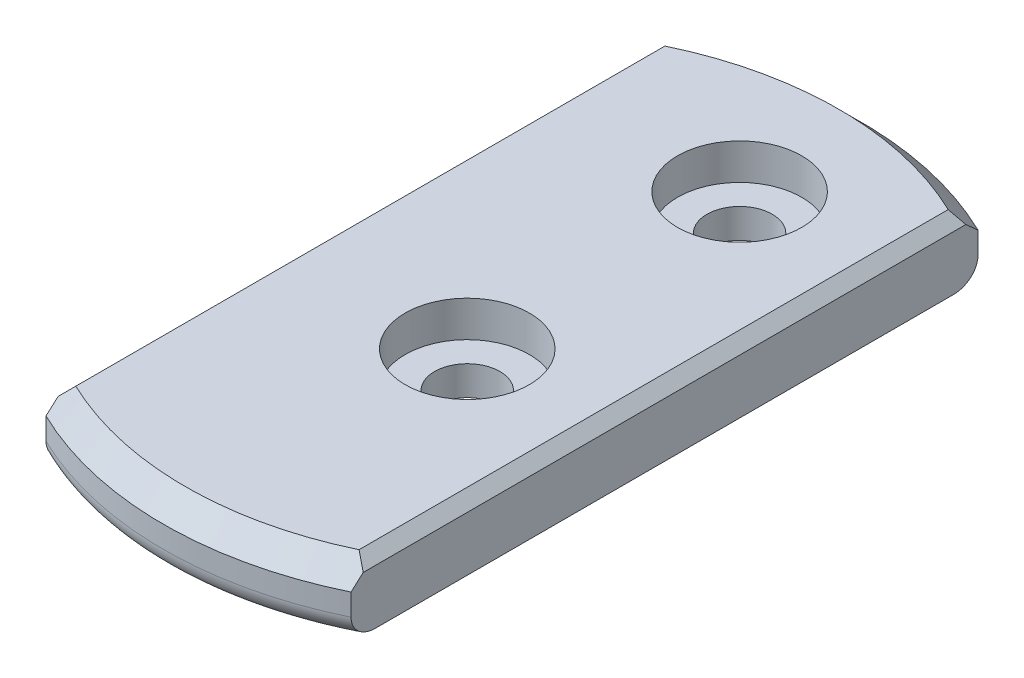
ISO-10303-21;
HEADER;
FILE_DESCRIPTION(('STEP AP214'),'2;1');
FILE_NAME('part.step','',(''),(''),'','','');
FILE_SCHEMA(('AUTOMOTIVE_DESIGN { 1 0 10303 214 1 1 1 1 }'));
ENDSEC;
DATA;
#1=APPLICATION_CONTEXT('core data for automotive mechanical design processes');
#2=APPLICATION_PROTOCOL_DEFINITION('international standard','automotive_design',2000,#1);
#3=PRODUCT_CONTEXT('',#1,'mechanical');
#4=PRODUCT('Part','Part','',(#3));
#5=PRODUCT_RELATED_PRODUCT_CATEGORY('part','',(#4));
#6=PRODUCT_DEFINITION_FORMATION('','',#4);
#7=PRODUCT_DEFINITION_CONTEXT('part definition',#1,'design');
#8=PRODUCT_DEFINITION('design','',#6,#7);
#9=PRODUCT_DEFINITION_SHAPE('','',#8);
#10=(LENGTH_UNIT() NAMED_UNIT(*) SI_UNIT(.MILLI.,.METRE.));
#11=(NAMED_UNIT(*) PLANE_ANGLE_UNIT() SI_UNIT($,.RADIAN.));
#12=(NAMED_UNIT(*) SI_UNIT($,.STERADIAN.) SOLID_ANGLE_UNIT());
#13=UNCERTAINTY_MEASURE_WITH_UNIT(LENGTH_MEASURE(1.E-05),#10,'distance_accuracy_value','');
#14=(GEOMETRIC_REPRESENTATION_CONTEXT(3) GLOBAL_UNCERTAINTY_ASSIGNED_CONTEXT((#13)) GLOBAL_UNIT_ASSIGNED_CONTEXT((#10,
#11,#12)) REPRESENTATION_CONTEXT('',''));
#15=CARTESIAN_POINT('',(0.,0.,0.));
#16=DIRECTION('',(0.,0.,1.));
#17=DIRECTION('',(1.,0.,0.));
#18=AXIS2_PLACEMENT_3D('',#15,#16,#17);
#19=CARTESIAN_POINT('',(0.999999999999996,0.,3.0528));
#20=DIRECTION('',(0.,1.,0.));
#21=DIRECTION('',(0.,0.,1.));
#22=AXIS2_PLACEMENT_3D('',#19,#20,#21);
#23=CYLINDRICAL_SURFACE('',#22,1.5);
#24=CARTESIAN_POINT('',(0.999999999999996,0.,3.0528));
#25=DIRECTION('',(0.,1.,0.));
#26=DIRECTION('',(0.,0.,1.));
#27=AXIS2_PLACEMENT_3D('',#24,#25,#26);
#28=CIRCLE('',#27,1.5);
#29=CARTESIAN_POINT('',(0.999999999999996,0.,4.5528));
#30=VERTEX_POINT('',#29);
#31=EDGE_CURVE('E280',#30,#30,#28,.T.);
#32=ORIENTED_EDGE('',*,*,#31,.F.);
#33=EDGE_LOOP('',(#32));
#34=FACE_BOUND('',#33,.T.);
#35=CARTESIAN_POINT('',(0.999999999999996,1.35,3.0528));
#36=DIRECTION('',(0.,1.,0.));
#37=DIRECTION('',(0.,0.,1.));
#38=AXIS2_PLACEMENT_3D('',#35,#36,#37);
#39=CIRCLE('',#38,1.5);
#40=CARTESIAN_POINT('',(0.999999999999996,1.35,4.5528));
#41=VERTEX_POINT('',#40);
#42=EDGE_CURVE('E276',#41,#41,#39,.F.);
#43=ORIENTED_EDGE('',*,*,#42,.F.);
#44=EDGE_LOOP('',(#43));
#45=FACE_BOUND('',#44,.T.);
#46=ADVANCED_FACE('F32',(#34,#45),#23,.F.);
#47=CARTESIAN_POINT('',(0.999999999999996,0.,-9.4472));
#48=DIRECTION('',(0.,1.,0.));
#49=DIRECTION('',(0.,0.,1.));
#50=AXIS2_PLACEMENT_3D('',#47,#48,#49);
#51=CYLINDRICAL_SURFACE('',#50,1.5);
#52=CARTESIAN_POINT('',(0.999999999999996,0.,-9.4472));
#53=DIRECTION('',(0.,1.,0.));
#54=DIRECTION('',(0.,0.,1.));
#55=AXIS2_PLACEMENT_3D('',#52,#53,#54);
#56=CIRCLE('',#55,1.5);
#57=CARTESIAN_POINT('',(0.999999999999996,0.,-7.9472));
#58=VERTEX_POINT('',#57);
#59=EDGE_CURVE('E344',#58,#58,#56,.T.);
#60=ORIENTED_EDGE('',*,*,#59,.F.);
#61=EDGE_LOOP('',(#60));
#62=FACE_BOUND('',#61,.T.);
#63=CARTESIAN_POINT('',(0.999999999999996,1.35,-9.4472));
#64=DIRECTION('',(0.,1.,0.));
#65=DIRECTION('',(0.,0.,1.));
#66=AXIS2_PLACEMENT_3D('',#63,#64,#65);
#67=CIRCLE('',#66,1.5);
#68=CARTESIAN_POINT('',(0.999999999999996,1.35,-7.9472));
#69=VERTEX_POINT('',#68);
#70=EDGE_CURVE('E273',#69,#69,#67,.F.);
#71=ORIENTED_EDGE('',*,*,#70,.F.);
#72=EDGE_LOOP('',(#71));
#73=FACE_BOUND('',#72,.T.);
#74=ADVANCED_FACE('F301',(#62,#73),#51,.F.);
#75=CARTESIAN_POINT('',(0.,3.,0.));
#76=DIRECTION('',(0.,-1.,0.));
#77=DIRECTION('',(0.,0.,-1.));
#78=AXIS2_PLACEMENT_3D('',#75,#76,#77);
#79=CYLINDRICAL_SURFACE('',#78,16.);
#80=DIRECTION('',(0.,-1.,0.));
#81=VECTOR('',#80,1.);
#82=CARTESIAN_POINT('',(-7.,3.,-14.3874945699382));
#83=LINE('',#82,#81);
#84=CARTESIAN_POINT('',(-7.,2.,-14.3874945699382));
#85=VERTEX_POINT('',#84);
#86=CARTESIAN_POINT('',(-7.,1.,-14.3874945699382));
#87=VERTEX_POINT('',#86);
#88=EDGE_CURVE('E108',#85,#87,#83,.T.);
#89=ORIENTED_EDGE('',*,*,#88,.F.);
#90=CARTESIAN_POINT('',(0.,2.,0.));
#91=DIRECTION('',(0.,1.,0.));
#92=DIRECTION('',(0.,0.,1.));
#93=AXIS2_PLACEMENT_3D('',#90,#91,#92);
#94=CIRCLE('',#93,16.);
#95=CARTESIAN_POINT('',(7.,2.,-14.3874945699382));
#96=VERTEX_POINT('',#95);
#97=EDGE_CURVE('E11',#85,#96,#94,.F.);
#98=ORIENTED_EDGE('',*,*,#97,.T.);
#99=DIRECTION('',(0.,-1.,0.));
#100=VECTOR('',#99,1.);
#101=CARTESIAN_POINT('',(7.,3.,-14.3874945699382));
#102=LINE('',#101,#100);
#103=CARTESIAN_POINT('',(7.,1.,-14.3874945699382));
#104=VERTEX_POINT('',#103);
#105=EDGE_CURVE('E135',#104,#96,#102,.F.);
#106=ORIENTED_EDGE('',*,*,#105,.F.);
#107=CARTESIAN_POINT('',(0.,1.,0.));
#108=DIRECTION('',(0.,1.,0.));
#109=DIRECTION('',(0.,0.,1.));
#110=AXIS2_PLACEMENT_3D('',#107,#108,#109);
#111=CIRCLE('',#110,16.);
#112=EDGE_CURVE('E127',#104,#87,#111,.T.);
#113=ORIENTED_EDGE('',*,*,#112,.T.);
#114=EDGE_LOOP('',(#89,#98,#106,#113));
#115=FACE_BOUND('',#114,.T.);
#116=ADVANCED_FACE('F133',(#115),#79,.T.);
#117=DIRECTION('',(0.,-1.,0.));
#118=VECTOR('',#117,1.);
#119=CARTESIAN_POINT('',(7.,3.,14.3874945699382));
#120=LINE('',#119,#118);
#121=CARTESIAN_POINT('',(7.,2.,14.3874945699382));
#122=VERTEX_POINT('',#121);
#123=CARTESIAN_POINT('',(7.,1.,14.3874945699382));
#124=VERTEX_POINT('',#123);
#125=EDGE_CURVE('E350',#122,#124,#120,.T.);
#126=ORIENTED_EDGE('',*,*,#125,.F.);
#127=CARTESIAN_POINT('',(0.,2.,0.));
#128=DIRECTION('',(0.,1.,0.));
#129=DIRECTION('',(0.,0.,1.));
#130=AXIS2_PLACEMENT_3D('',#127,#128,#129);
#131=CIRCLE('',#130,16.);
#132=CARTESIAN_POINT('',(-7.,2.,14.3874945699382));
#133=VERTEX_POINT('',#132);
#134=EDGE_CURVE('E212',#122,#133,#131,.F.);
#135=ORIENTED_EDGE('',*,*,#134,.T.);
#136=DIRECTION('',(0.,-1.,0.));
#137=VECTOR('',#136,1.);
#138=CARTESIAN_POINT('',(-7.,3.,14.3874945699382));
#139=LINE('',#138,#137);
#140=CARTESIAN_POINT('',(-7.,1.,14.3874945699382));
#141=VERTEX_POINT('',#140);
#142=EDGE_CURVE('E120',#141,#133,#139,.F.);
#143=ORIENTED_EDGE('',*,*,#142,.F.);
#144=CARTESIAN_POINT('',(0.,1.,0.));
#145=DIRECTION('',(0.,1.,0.));
#146=DIRECTION('',(0.,0.,1.));
#147=AXIS2_PLACEMENT_3D('',#144,#145,#146);
#148=CIRCLE('',#147,16.);
#149=EDGE_CURVE('E255',#141,#124,#148,.T.);
#150=ORIENTED_EDGE('',*,*,#149,.T.);
#151=EDGE_LOOP('',(#126,#135,#143,#150));
#152=FACE_BOUND('',#151,.T.);
#153=ADVANCED_FACE('F352',(#152),#79,.T.);
#154=CARTESIAN_POINT('',(0.,3.,0.));
#155=DIRECTION('',(0.,1.,0.));
#156=DIRECTION('',(0.,0.,1.));
#157=AXIS2_PLACEMENT_3D('',#154,#155,#156);
#158=PLANE('',#157);
#159=CARTESIAN_POINT('',(0.999999999999996,3.,-9.4472));
#160=DIRECTION('',(0.,1.,0.));
#161=DIRECTION('',(0.,0.,1.));
#162=AXIS2_PLACEMENT_3D('',#159,#160,#161);
#163=CIRCLE('',#162,2.85);
#164=CARTESIAN_POINT('',(0.999999999999996,3.,-6.5972));
#165=VERTEX_POINT('',#164);
#166=EDGE_CURVE('E333',#165,#165,#163,.T.);
#167=ORIENTED_EDGE('',*,*,#166,.F.);
#168=EDGE_LOOP('',(#167));
#169=FACE_BOUND('',#168,.T.);
#170=CARTESIAN_POINT('',(0.999999999999996,3.,3.0528));
#171=DIRECTION('',(0.,1.,0.));
#172=DIRECTION('',(0.,0.,1.));
#173=AXIS2_PLACEMENT_3D('',#170,#171,#172);
#174=CIRCLE('',#173,2.85);
#175=CARTESIAN_POINT('',(0.999999999999996,3.,5.9028));
#176=VERTEX_POINT('',#175);
#177=EDGE_CURVE('E341',#176,#176,#174,.T.);
#178=ORIENTED_EDGE('',*,*,#177,.F.);
#179=EDGE_LOOP('',(#178));
#180=FACE_BOUND('',#179,.T.);
#181=DIRECTION('',(0.,0.,1.));
#182=VECTOR('',#181,1.);
#183=CARTESIAN_POINT('',(-6.5,3.,0.));
#184=LINE('',#183,#182);
#185=CARTESIAN_POINT('',(-6.5,3.,-13.5185058345958));
#186=VERTEX_POINT('',#185);
#187=CARTESIAN_POINT('',(-6.5,3.,13.5185058345958));
#188=VERTEX_POINT('',#187);
#189=EDGE_CURVE('E140',#186,#188,#184,.T.);
#190=ORIENTED_EDGE('',*,*,#189,.T.);
#191=CARTESIAN_POINT('',(0.,3.,0.));
#192=DIRECTION('',(0.,1.,0.));
#193=DIRECTION('',(0.,0.,1.));
#194=AXIS2_PLACEMENT_3D('',#191,#192,#193);
#195=CIRCLE('',#194,15.);
#196=CARTESIAN_POINT('',(6.5,3.,13.5185058345958));
#197=VERTEX_POINT('',#196);
#198=EDGE_CURVE('E250',#188,#197,#195,.T.);
#199=ORIENTED_EDGE('',*,*,#198,.T.);
#200=DIRECTION('',(0.,0.,-1.));
#201=VECTOR('',#200,1.);
#202=CARTESIAN_POINT('',(6.49999999999999,3.,0.));
#203=LINE('',#202,#201);
#204=CARTESIAN_POINT('',(6.49999999999999,3.,-13.5185058345958));
#205=VERTEX_POINT('',#204);
#206=EDGE_CURVE('E282',#197,#205,#203,.T.);
#207=ORIENTED_EDGE('',*,*,#206,.T.);
#208=CARTESIAN_POINT('',(0.,3.,0.));
#209=DIRECTION('',(0.,1.,0.));
#210=DIRECTION('',(0.,0.,1.));
#211=AXIS2_PLACEMENT_3D('',#208,#209,#210);
#212=CIRCLE('',#211,15.);
#213=EDGE_CURVE('E253',#205,#186,#212,.T.);
#214=ORIENTED_EDGE('',*,*,#213,.T.);
#215=EDGE_LOOP('',(#190,#199,#207,#214));
#216=FACE_BOUND('',#215,.T.);
#217=ADVANCED_FACE('F187',(#169,#180,#216),#158,.T.);
#218=CARTESIAN_POINT('',(0.,0.,0.));
#219=DIRECTION('',(0.,1.,0.));
#220=DIRECTION('',(0.,0.,1.));
#221=AXIS2_PLACEMENT_3D('',#218,#219,#220);
#222=PLANE('',#221);
#223=ORIENTED_EDGE('',*,*,#59,.T.);
#224=EDGE_LOOP('',(#223));
#225=FACE_BOUND('',#224,.T.);
#226=ORIENTED_EDGE('',*,*,#31,.T.);
#227=EDGE_LOOP('',(#226));
#228=FACE_BOUND('',#227,.T.);
#229=DIRECTION('',(0.,0.,1.));
#230=VECTOR('',#229,1.);
#231=CARTESIAN_POINT('',(-7.,0.,0.));
#232=LINE('',#231,#230);
#233=CARTESIAN_POINT('',(-7.,0.,-13.2664991614216));
#234=VERTEX_POINT('',#233);
#235=CARTESIAN_POINT('',(-7.,0.,13.2664991614216));
#236=VERTEX_POINT('',#235);
#237=EDGE_CURVE('E267',#234,#236,#232,.T.);
#238=ORIENTED_EDGE('',*,*,#237,.F.);
#239=CARTESIAN_POINT('',(0.,0.,0.));
#240=DIRECTION('',(0.,1.,0.));
#241=DIRECTION('',(0.,0.,1.));
#242=AXIS2_PLACEMENT_3D('',#239,#240,#241);
#243=CIRCLE('',#242,15.);
#244=CARTESIAN_POINT('',(7.,0.,-13.2664991614216));
#245=VERTEX_POINT('',#244);
#246=EDGE_CURVE('E128',#234,#245,#243,.F.);
#247=ORIENTED_EDGE('',*,*,#246,.T.);
#248=DIRECTION('',(0.,0.,-1.));
#249=VECTOR('',#248,1.);
#250=CARTESIAN_POINT('',(7.,0.,0.));
#251=LINE('',#250,#249);
#252=CARTESIAN_POINT('',(7.,0.,13.2664991614216));
#253=VERTEX_POINT('',#252);
#254=EDGE_CURVE('E119',#253,#245,#251,.T.);
#255=ORIENTED_EDGE('',*,*,#254,.F.);
#256=CARTESIAN_POINT('',(0.,0.,0.));
#257=DIRECTION('',(0.,1.,0.));
#258=DIRECTION('',(0.,0.,1.));
#259=AXIS2_PLACEMENT_3D('',#256,#257,#258);
#260=CIRCLE('',#259,15.);
#261=EDGE_CURVE('E129',#253,#236,#260,.F.);
#262=ORIENTED_EDGE('',*,*,#261,.T.);
#263=EDGE_LOOP('',(#238,#247,#255,#262));
#264=FACE_BOUND('',#263,.T.);
#265=ADVANCED_FACE('F185',(#225,#228,#264),#222,.F.);
#266=CARTESIAN_POINT('',(7.,3.,-16.));
#267=DIRECTION('',(1.,0.,0.));
#268=DIRECTION('',(0.,0.,-1.));
#269=AXIS2_PLACEMENT_3D('',#266,#267,#268);
#270=PLANE('',#269);
#271=DIRECTION('',(0.,0.,1.));
#272=VECTOR('',#271,1.);
#273=CARTESIAN_POINT('',(7.,2.5,-16.));
#274=LINE('',#273,#272);
#275=CARTESIAN_POINT('',(7.,2.5,-13.8293166859393));
#276=VERTEX_POINT('',#275);
#277=CARTESIAN_POINT('',(7.,2.5,13.8293166859393));
#278=VERTEX_POINT('',#277);
#279=EDGE_CURVE('E136',#276,#278,#274,.T.);
#280=ORIENTED_EDGE('',*,*,#279,.T.);
#281=CARTESIAN_POINT('',(7.,2.5,13.8293166859393));
#282=CARTESIAN_POINT('',(7.,2.41684738393605,13.9225082172146));
#283=CARTESIAN_POINT('',(7.,2.33360440861209,14.0156188072142));
#284=CARTESIAN_POINT('',(7.,2.16693774194001,14.2016781018756));
#285=CARTESIAN_POINT('',(7.,2.08351405059731,14.2946268065423));
#286=CARTESIAN_POINT('',(7.,2.,14.3874945699382));
#287=B_SPLINE_CURVE_WITH_KNOTS('',3,(#281,#282,#283,#284,#285,#286),.UNSPECIFIED.,.F.,.F.,(4,2,
4),(0.,0.374687568779244,0.749375126336384),.UNSPECIFIED.);
#288=EDGE_CURVE('E200',#278,#122,#287,.T.);
#289=ORIENTED_EDGE('',*,*,#288,.T.);
#290=ORIENTED_EDGE('',*,*,#125,.T.);
#291=CARTESIAN_POINT('',(7.,1.,14.3874945699382));
#292=CARTESIAN_POINT('',(7.,0.973940110756087,14.387495756095));
#293=CARTESIAN_POINT('',(7.,0.947893469493188,14.386360899822));
#294=CARTESIAN_POINT('',(7.,0.896002215196319,14.3818428096351));
#295=CARTESIAN_POINT('',(7.,0.870157554375777,14.3784601248966));
#296=CARTESIAN_POINT('',(7.,0.793386506666994,14.3650128551536));
#297=CARTESIAN_POINT('',(7.,0.743000995261251,14.3516485917777));
#298=CARTESIAN_POINT('',(7.,0.645239010766344,14.3166990868896));
#299=CARTESIAN_POINT('',(7.,0.59786116929623,14.295117615641));
#300=CARTESIAN_POINT('',(7.,0.507192731659557,14.2445873854869));
#301=CARTESIAN_POINT('',(7.,0.463904476169754,14.2156344421226));
#302=CARTESIAN_POINT('',(7.,0.380766556757787,14.1501584203978));
#303=CARTESIAN_POINT('',(7.,0.341113190646302,14.1133870061599));
#304=CARTESIAN_POINT('',(7.,0.267893743995757,14.0342358511959));
#305=CARTESIAN_POINT('',(7.,0.234328824642291,13.9918550433094));
#306=CARTESIAN_POINT('',(7.,0.170823373199901,13.8984191279049));
#307=CARTESIAN_POINT('',(7.,0.141533646267683,13.8469222326654));
#308=CARTESIAN_POINT('',(7.,0.0910598128925209,13.7400671466706));
#309=CARTESIAN_POINT('',(7.,0.0698835143724796,13.6847052967459));
#310=CARTESIAN_POINT('',(7.,0.0351877353554741,13.5695194461642));
#311=CARTESIAN_POINT('',(7.,0.0219635190564369,13.5096070040123));
#312=CARTESIAN_POINT('',(7.,0.00437234289903576,13.388616505444));
#313=CARTESIAN_POINT('',(7.,-1.27398754447577E-05,13.3275410937044));
#314=CARTESIAN_POINT('',(7.,0.,13.2664991614216));
#315=B_SPLINE_CURVE_WITH_KNOTS('',3,(#291,#292,#293,#294,#295,#296,#297,#298,#299,#300,#301,
#302,#303,#304,#305,#306,#307,#308,#309,#310,#311,#312,#313,#314),.UNSPECIFIED.,.F.,.F.,(4,2,2,
2,2,2,2,2,2,2,2,4),(0.,0.0781290365650729,0.156238992147994,0.31180164841213,0.467293014426822,
0.622872843579735,0.784436705579072,0.946031348635806,1.12303501212821,1.30020858902768,
1.48360910522238,1.66663321044829),.UNSPECIFIED.);
#316=EDGE_CURVE('E168',#124,#253,#315,.T.);
#317=ORIENTED_EDGE('',*,*,#316,.T.);
#318=ORIENTED_EDGE('',*,*,#254,.T.);
#319=CARTESIAN_POINT('',(6.99999999999999,0.,-13.2664991614216));
#320=CARTESIAN_POINT('',(7.,-2.16895367781152E-05,-13.3358717509968));
#321=CARTESIAN_POINT('',(7.,0.00564786564525644,-13.4052983157841));
#322=CARTESIAN_POINT('',(7.,0.0284062985324383,-13.542523750814));
#323=CARTESIAN_POINT('',(7.,0.0455396443571911,-13.610315213447));
#324=CARTESIAN_POINT('',(7.,0.0913133437973604,-13.7421078492374));
#325=CARTESIAN_POINT('',(7.,0.119979095635525,-13.8061002963573));
#326=CARTESIAN_POINT('',(7.,0.188485910766486,-13.9277221179372));
#327=CARTESIAN_POINT('',(7.,0.228308678880043,-13.9853616959642));
#328=CARTESIAN_POINT('',(7.,0.3149126437186,-14.0877214217607));
#329=CARTESIAN_POINT('',(7.,0.360918139959822,-14.1330957859158));
#330=CARTESIAN_POINT('',(7.,0.460768958731949,-14.2142825186899));
#331=CARTESIAN_POINT('',(7.,0.51461217805792,-14.2500974452423));
#332=CARTESIAN_POINT('',(7.,0.621925929471326,-14.3067860542372));
#333=CARTESIAN_POINT('',(7.,0.674747590584073,-14.3288927794395));
#334=CARTESIAN_POINT('',(7.,0.783517371827637,-14.362926971292));
#335=CARTESIAN_POINT('',(7.,0.839457836688216,-14.374878286026));
#336=CARTESIAN_POINT('',(7.,0.913214612308462,-14.3834688987082));
#337=CARTESIAN_POINT('',(7.,0.930550658809079,-14.3849786985549));
#338=CARTESIAN_POINT('',(7.,0.965254954393981,-14.3869900541937));
#339=CARTESIAN_POINT('',(7.,0.982623115560809,-14.3874931261847));
#340=CARTESIAN_POINT('',(7.,1.,-14.3874945699382));
#341=B_SPLINE_CURVE_WITH_KNOTS('',3,(#319,#320,#321,#322,#323,#324,#325,#326,#327,#328,#329,
#330,#331,#332,#333,#334,#335,#336,#337,#338,#339,#340),.UNSPECIFIED.,.F.,.F.,(4,2,2,2,2,2,2,2,
2,2,4),(0.,0.207974645201937,0.416760738824993,0.626009188815843,0.834916503307373,
1.02767749077108,1.22038684703616,1.3912635862794,1.56173793565953,1.6139225630931,
1.66602853769447),.UNSPECIFIED.);
#342=EDGE_CURVE('E175',#245,#104,#341,.T.);
#343=ORIENTED_EDGE('',*,*,#342,.T.);
#344=ORIENTED_EDGE('',*,*,#105,.T.);
#345=CARTESIAN_POINT('',(7.,2.,-14.3874945699382));
#346=CARTESIAN_POINT('',(7.,2.08351405059731,-14.2946268065423));
#347=CARTESIAN_POINT('',(7.,2.16693774194001,-14.2016781018756));
#348=CARTESIAN_POINT('',(7.,2.33360440861209,-14.0156188072142));
#349=CARTESIAN_POINT('',(7.,2.41684738393605,-13.9225082172146));
#350=CARTESIAN_POINT('',(7.,2.49999999999999,-13.8293166859393));
#351=B_SPLINE_CURVE_WITH_KNOTS('',3,(#345,#346,#347,#348,#349,#350),.UNSPECIFIED.,.F.,.F.,(4,2,
4),(0.,0.374687557557139,0.749375126336386),.UNSPECIFIED.);
#352=EDGE_CURVE('E194',#96,#276,#351,.T.);
#353=ORIENTED_EDGE('',*,*,#352,.T.);
#354=EDGE_LOOP('',(#280,#289,#290,#317,#318,#343,#344,#353));
#355=FACE_BOUND('',#354,.T.);
#356=ADVANCED_FACE('F181',(#355),#270,.T.);
#357=CARTESIAN_POINT('',(-7.,3.,-16.));
#358=DIRECTION('',(-1.,0.,0.));
#359=DIRECTION('',(0.,0.,1.));
#360=AXIS2_PLACEMENT_3D('',#357,#358,#359);
#361=PLANE('',#360);
#362=ORIENTED_EDGE('',*,*,#142,.T.);
#363=CARTESIAN_POINT('',(-7.,2.,14.3874945699382));
#364=CARTESIAN_POINT('',(-7.,2.08351405059731,14.2946268065423));
#365=CARTESIAN_POINT('',(-7.,2.16693774194001,14.2016781018756));
#366=CARTESIAN_POINT('',(-7.,2.33360440861209,14.0156188072142));
#367=CARTESIAN_POINT('',(-7.,2.41684738393606,13.9225082172146));
#368=CARTESIAN_POINT('',(-7.,2.5,13.8293166859393));
#369=B_SPLINE_CURVE_WITH_KNOTS('',3,(#363,#364,#365,#366,#367,#368),.UNSPECIFIED.,.F.,.F.,(4,2,
4),(0.,0.374687557557146,0.749375126336396),.UNSPECIFIED.);
#370=CARTESIAN_POINT('',(-7.,2.5,13.8293166859393));
#371=VERTEX_POINT('',#370);
#372=EDGE_CURVE('E55',#133,#371,#369,.T.);
#373=ORIENTED_EDGE('',*,*,#372,.T.);
#374=DIRECTION('',(0.,0.,-1.));
#375=VECTOR('',#374,1.);
#376=CARTESIAN_POINT('',(-7.,2.5,-16.));
#377=LINE('',#376,#375);
#378=CARTESIAN_POINT('',(-7.,2.5,-13.8293166859393));
#379=VERTEX_POINT('',#378);
#380=EDGE_CURVE('E269',#371,#379,#377,.T.);
#381=ORIENTED_EDGE('',*,*,#380,.T.);
#382=CARTESIAN_POINT('',(-7.,2.5,-13.8293166859393));
#383=CARTESIAN_POINT('',(-7.,2.41684738393606,-13.9225082172146));
#384=CARTESIAN_POINT('',(-7.,2.3336044086121,-14.0156188072142));
#385=CARTESIAN_POINT('',(-7.,2.16693774194001,-14.2016781018756));
#386=CARTESIAN_POINT('',(-7.,2.08351405059731,-14.2946268065423));
#387=CARTESIAN_POINT('',(-7.,2.,-14.3874945699382));
#388=B_SPLINE_CURVE_WITH_KNOTS('',3,(#382,#383,#384,#385,#386,#387),.UNSPECIFIED.,.F.,.F.,(4,2,
4),(0.,0.37468756877925,0.749375126336395),.UNSPECIFIED.);
#389=EDGE_CURVE('E115',#379,#85,#388,.T.);
#390=ORIENTED_EDGE('',*,*,#389,.T.);
#391=ORIENTED_EDGE('',*,*,#88,.T.);
#392=CARTESIAN_POINT('',(-7.,1.,-14.3874945699382));
#393=CARTESIAN_POINT('',(-7.,0.973940110756087,-14.387495756095));
#394=CARTESIAN_POINT('',(-7.,0.947893469493188,-14.386360899822));
#395=CARTESIAN_POINT('',(-7.,0.896002215196319,-14.3818428096351));
#396=CARTESIAN_POINT('',(-7.,0.870157554375777,-14.3784601248966));
#397=CARTESIAN_POINT('',(-7.,0.793386506666994,-14.3650128551536));
#398=CARTESIAN_POINT('',(-7.,0.743000995261251,-14.3516485917777));
#399=CARTESIAN_POINT('',(-7.,0.645239010766344,-14.3166990868896));
#400=CARTESIAN_POINT('',(-7.,0.597861169296229,-14.295117615641));
#401=CARTESIAN_POINT('',(-7.,0.507192731659555,-14.2445873854869));
#402=CARTESIAN_POINT('',(-7.,0.463904476169753,-14.2156344421226));
#403=CARTESIAN_POINT('',(-7.,0.380766556757785,-14.1501584203978));
#404=CARTESIAN_POINT('',(-7.,0.341113190646302,-14.1133870061599));
#405=CARTESIAN_POINT('',(-7.,0.267893743995756,-14.0342358511959));
#406=CARTESIAN_POINT('',(-7.,0.234328824642289,-13.9918550433094));
#407=CARTESIAN_POINT('',(-7.,0.170823373199899,-13.8984191279049));
#408=CARTESIAN_POINT('',(-7.,0.141533646267682,-13.8469222326654));
#409=CARTESIAN_POINT('',(-7.,0.0910598128925209,-13.7400671466706));
#410=CARTESIAN_POINT('',(-7.,0.0698835143724796,-13.6847052967459));
#411=CARTESIAN_POINT('',(-7.,0.0351877353554741,-13.5695194461642));
#412=CARTESIAN_POINT('',(-7.,0.0219635190564371,-13.5096070040123));
#413=CARTESIAN_POINT('',(-7.,0.00437234289903607,-13.388616505444));
#414=CARTESIAN_POINT('',(-7.,-1.27398754444129E-05,-13.3275410937044));
#415=CARTESIAN_POINT('',(-7.,0.,-13.2664991614216));
#416=B_SPLINE_CURVE_WITH_KNOTS('',3,(#392,#393,#394,#395,#396,#397,#398,#399,#400,#401,#402,
#403,#404,#405,#406,#407,#408,#409,#410,#411,#412,#413,#414,#415),.UNSPECIFIED.,.F.,.F.,(4,2,2,
2,2,2,2,2,2,2,2,4),(0.,0.0781290365650733,0.156238992147994,0.311801648412131,0.467293014426822,
0.622872843579735,0.784436705579074,0.946031348635808,1.12303501212822,1.30020858902769,
1.48360910522238,1.66663321044829),.UNSPECIFIED.);
#417=EDGE_CURVE('E112',#87,#234,#416,.T.);
#418=ORIENTED_EDGE('',*,*,#417,.T.);
#419=ORIENTED_EDGE('',*,*,#237,.T.);
#420=CARTESIAN_POINT('',(-7.,0.,13.2664991614216));
#421=CARTESIAN_POINT('',(-7.,-2.16895367781997E-05,13.3358717509968));
#422=CARTESIAN_POINT('',(-7.,0.0056478656452563,13.4052983157841));
#423=CARTESIAN_POINT('',(-7.,0.0284062985324383,13.542523750814));
#424=CARTESIAN_POINT('',(-7.,0.0455396443571916,13.610315213447));
#425=CARTESIAN_POINT('',(-7.,0.0913133437973619,13.7421078492374));
#426=CARTESIAN_POINT('',(-7.,0.119979095635527,13.8061002963573));
#427=CARTESIAN_POINT('',(-7.,0.188485910766487,13.9277221179372));
#428=CARTESIAN_POINT('',(-7.,0.228308678880045,13.9853616959642));
#429=CARTESIAN_POINT('',(-7.,0.314912643718602,14.0877214217607));
#430=CARTESIAN_POINT('',(-7.,0.360918139959825,14.1330957859158));
#431=CARTESIAN_POINT('',(-7.,0.460768958731952,14.2142825186899));
#432=CARTESIAN_POINT('',(-7.,0.514612178057924,14.2500974452423));
#433=CARTESIAN_POINT('',(-7.,0.621925929471331,14.3067860542372));
#434=CARTESIAN_POINT('',(-7.,0.674747590584079,14.3288927794395));
#435=CARTESIAN_POINT('',(-7.,0.783517371827642,14.362926971292));
#436=CARTESIAN_POINT('',(-7.,0.839457836688221,14.374878286026));
#437=CARTESIAN_POINT('',(-7.,0.913214612308466,14.3834688987082));
#438=CARTESIAN_POINT('',(-7.,0.930550658809082,14.3849786985549));
#439=CARTESIAN_POINT('',(-7.,0.965254954393983,14.3869900541937));
#440=CARTESIAN_POINT('',(-7.,0.98262311556081,14.3874931261847));
#441=CARTESIAN_POINT('',(-7.,1.,14.3874945699382));
#442=B_SPLINE_CURVE_WITH_KNOTS('',3,(#420,#421,#422,#423,#424,#425,#426,#427,#428,#429,#430,
#431,#432,#433,#434,#435,#436,#437,#438,#439,#440,#441),.UNSPECIFIED.,.F.,.F.,(4,2,2,2,2,2,2,2,
2,2,4),(0.,0.207974645201935,0.416760738824995,0.626009188815843,0.834916503307377,
1.02767749077108,1.22038684703617,1.3912635862794,1.56173793565953,1.6139225630931,
1.66602853769447),.UNSPECIFIED.);
#443=EDGE_CURVE('E130',#236,#141,#442,.T.);
#444=ORIENTED_EDGE('',*,*,#443,.T.);
#445=EDGE_LOOP('',(#362,#373,#381,#390,#391,#418,#419,#444));
#446=FACE_BOUND('',#445,.T.);
#447=ADVANCED_FACE('F110',(#446),#361,.T.);
#448=CARTESIAN_POINT('',(0.999999999999996,1.35,-9.4472));
#449=DIRECTION('',(0.,1.,0.));
#450=DIRECTION('',(0.,0.,1.));
#451=AXIS2_PLACEMENT_3D('',#448,#449,#450);
#452=PLANE('',#451);
#453=CARTESIAN_POINT('',(0.999999999999996,1.35,-9.4472));
#454=DIRECTION('',(0.,1.,0.));
#455=DIRECTION('',(0.,0.,1.));
#456=AXIS2_PLACEMENT_3D('',#453,#454,#455);
#457=CIRCLE('',#456,2.85);
#458=CARTESIAN_POINT('',(0.999999999999996,1.35,-6.5972));
#459=VERTEX_POINT('',#458);
#460=EDGE_CURVE('E277',#459,#459,#457,.T.);
#461=ORIENTED_EDGE('',*,*,#460,.T.);
#462=EDGE_LOOP('',(#461));
#463=FACE_BOUND('',#462,.T.);
#464=ORIENTED_EDGE('',*,*,#70,.T.);
#465=EDGE_LOOP('',(#464));
#466=FACE_BOUND('',#465,.T.);
#467=ADVANCED_FACE('F321',(#463,#466),#452,.T.);
#468=CARTESIAN_POINT('',(0.999999999999996,1.35,-9.4472));
#469=DIRECTION('',(0.,1.,0.));
#470=DIRECTION('',(0.,0.,1.));
#471=AXIS2_PLACEMENT_3D('',#468,#469,#470);
#472=CYLINDRICAL_SURFACE('',#471,2.85);
#473=ORIENTED_EDGE('',*,*,#460,.F.);
#474=EDGE_LOOP('',(#473));
#475=FACE_BOUND('',#474,.T.);
#476=ORIENTED_EDGE('',*,*,#166,.T.);
#477=EDGE_LOOP('',(#476));
#478=FACE_BOUND('',#477,.T.);
#479=ADVANCED_FACE('F317',(#475,#478),#472,.F.);
#480=CARTESIAN_POINT('',(0.999999999999996,1.35,3.0528));
#481=DIRECTION('',(0.,1.,0.));
#482=DIRECTION('',(0.,0.,1.));
#483=AXIS2_PLACEMENT_3D('',#480,#481,#482);
#484=PLANE('',#483);
#485=CARTESIAN_POINT('',(0.999999999999996,1.35,3.0528));
#486=DIRECTION('',(0.,1.,0.));
#487=DIRECTION('',(0.,0.,1.));
#488=AXIS2_PLACEMENT_3D('',#485,#486,#487);
#489=CIRCLE('',#488,2.85);
#490=CARTESIAN_POINT('',(0.999999999999996,1.35,5.9028));
#491=VERTEX_POINT('',#490);
#492=EDGE_CURVE('E336',#491,#491,#489,.T.);
#493=ORIENTED_EDGE('',*,*,#492,.T.);
#494=EDGE_LOOP('',(#493));
#495=FACE_BOUND('',#494,.T.);
#496=ORIENTED_EDGE('',*,*,#42,.T.);
#497=EDGE_LOOP('',(#496));
#498=FACE_BOUND('',#497,.T.);
#499=ADVANCED_FACE('F313',(#495,#498),#484,.T.);
#500=CARTESIAN_POINT('',(0.999999999999996,1.35,3.0528));
#501=DIRECTION('',(0.,1.,0.));
#502=DIRECTION('',(0.,0.,1.));
#503=AXIS2_PLACEMENT_3D('',#500,#501,#502);
#504=CYLINDRICAL_SURFACE('',#503,2.85);
#505=ORIENTED_EDGE('',*,*,#492,.F.);
#506=EDGE_LOOP('',(#505));
#507=FACE_BOUND('',#506,.T.);
#508=ORIENTED_EDGE('',*,*,#177,.T.);
#509=EDGE_LOOP('',(#508));
#510=FACE_BOUND('',#509,.T.);
#511=ADVANCED_FACE('F238',(#507,#510),#504,.F.);
#512=CARTESIAN_POINT('',(-7.,2.5,-16.));
#513=DIRECTION('',(0.707106781186547,-0.707106781186548,0.));
#514=DIRECTION('',(0.,0.,-1.));
#515=AXIS2_PLACEMENT_3D('',#512,#513,#514);
#516=PLANE('',#515);
#517=ORIENTED_EDGE('',*,*,#380,.F.);
#518=CARTESIAN_POINT('',(-7.,2.5,13.8293166859393));
#519=CARTESIAN_POINT('',(-6.91651332083652,2.58348667916348,13.7780082738407));
#520=CARTESIAN_POINT('',(-6.83310331757587,2.66689668242413,13.7264531653912));
#521=CARTESIAN_POINT('',(-6.66643665088717,2.83356334911283,13.6228495483476));
#522=CARTESIAN_POINT('',(-6.58317998748116,2.91682001251884,13.5708010396826));
#523=CARTESIAN_POINT('',(-6.5,3.,13.5185058345958));
#524=B_SPLINE_CURVE_WITH_KNOTS('',3,(#518,#519,#520,#521,#522,#523),.UNSPECIFIED.,.F.,.F.,(4,2,
4),(0.,0.386201344451475,0.772402744391065),.UNSPECIFIED.);
#525=EDGE_CURVE('E41',#371,#188,#524,.T.);
#526=ORIENTED_EDGE('',*,*,#525,.T.);
#527=ORIENTED_EDGE('',*,*,#189,.F.);
#528=CARTESIAN_POINT('',(-6.5,3.,-13.5185058345958));
#529=CARTESIAN_POINT('',(-6.58317998748116,2.91682001251884,-13.5708010396826));
#530=CARTESIAN_POINT('',(-6.66643665088718,2.83356334911283,-13.6228495483476));
#531=CARTESIAN_POINT('',(-6.83310331757587,2.66689668242413,-13.7264531653912));
#532=CARTESIAN_POINT('',(-6.91651332083652,2.58348667916348,-13.7780082738407));
#533=CARTESIAN_POINT('',(-7.,2.5,-13.8293166859393));
#534=B_SPLINE_CURVE_WITH_KNOTS('',3,(#528,#529,#530,#531,#532,#533),.UNSPECIFIED.,.F.,.F.,(4,2,
4),(0.,0.38620139993959,0.772402744391065),.UNSPECIFIED.);
#535=EDGE_CURVE('E48',#186,#379,#534,.T.);
#536=ORIENTED_EDGE('',*,*,#535,.T.);
#537=EDGE_LOOP('',(#517,#526,#527,#536));
#538=FACE_BOUND('',#537,.T.);
#539=ADVANCED_FACE('F233',(#538),#516,.F.);
#540=CARTESIAN_POINT('',(7.,2.5,-16.));
#541=DIRECTION('',(-0.707106781186547,-0.707106781186548,0.));
#542=DIRECTION('',(0.,0.,1.));
#543=AXIS2_PLACEMENT_3D('',#540,#541,#542);
#544=PLANE('',#543);
#545=ORIENTED_EDGE('',*,*,#206,.F.);
#546=CARTESIAN_POINT('',(6.5,3.,13.5185058345958));
#547=CARTESIAN_POINT('',(6.58317998748115,2.91682001251884,13.5708010396826));
#548=CARTESIAN_POINT('',(6.66643665088717,2.83356334911283,13.6228495483476));
#549=CARTESIAN_POINT('',(6.83310331757587,2.66689668242413,13.7264531653912));
#550=CARTESIAN_POINT('',(6.91651332083652,2.58348667916347,13.7780082738407));
#551=CARTESIAN_POINT('',(7.,2.5,13.8293166859393));
#552=B_SPLINE_CURVE_WITH_KNOTS('',3,(#546,#547,#548,#549,#550,#551),.UNSPECIFIED.,.F.,.F.,(4,2,
4),(0.,0.386201399939595,0.772402744391077),.UNSPECIFIED.);
#553=EDGE_CURVE('E201',#197,#278,#552,.T.);
#554=ORIENTED_EDGE('',*,*,#553,.T.);
#555=ORIENTED_EDGE('',*,*,#279,.F.);
#556=CARTESIAN_POINT('',(7.,2.5,-13.8293166859393));
#557=CARTESIAN_POINT('',(6.91651332083652,2.58348667916347,-13.7780082738407));
#558=CARTESIAN_POINT('',(6.83310331757587,2.66689668242412,-13.7264531653912));
#559=CARTESIAN_POINT('',(6.66643665088717,2.83356334911283,-13.6228495483476));
#560=CARTESIAN_POINT('',(6.58317998748115,2.91682001251884,-13.5708010396826));
#561=CARTESIAN_POINT('',(6.49999999999999,3.,-13.5185058345958));
#562=B_SPLINE_CURVE_WITH_KNOTS('',3,(#556,#557,#558,#559,#560,#561),.UNSPECIFIED.,.F.,.F.,(4,2,
4),(0.,0.386201344451481,0.772402744391077),.UNSPECIFIED.);
#563=EDGE_CURVE('E244',#276,#205,#562,.T.);
#564=ORIENTED_EDGE('',*,*,#563,.T.);
#565=EDGE_LOOP('',(#545,#554,#555,#564));
#566=FACE_BOUND('',#565,.T.);
#567=ADVANCED_FACE('F237',(#566),#544,.F.);
#568=CARTESIAN_POINT('',(0.,1.,0.));
#569=DIRECTION('',(0.,1.,0.));
#570=DIRECTION('',(0.,0.,1.));
#571=AXIS2_PLACEMENT_3D('',#568,#569,#570);
#572=TOROIDAL_SURFACE('',#571,15.,1.);
#573=ORIENTED_EDGE('',*,*,#342,.F.);
#574=ORIENTED_EDGE('',*,*,#246,.F.);
#575=ORIENTED_EDGE('',*,*,#417,.F.);
#576=ORIENTED_EDGE('',*,*,#112,.F.);
#577=EDGE_LOOP('',(#573,#574,#575,#576));
#578=FACE_BOUND('',#577,.T.);
#579=ADVANCED_FACE('F126',(#578),#572,.T.);
#580=CARTESIAN_POINT('',(0.,1.,0.));
#581=DIRECTION('',(0.,1.,0.));
#582=DIRECTION('',(0.,0.,1.));
#583=AXIS2_PLACEMENT_3D('',#580,#581,#582);
#584=TOROIDAL_SURFACE('',#583,15.,1.);
#585=ORIENTED_EDGE('',*,*,#443,.F.);
#586=ORIENTED_EDGE('',*,*,#261,.F.);
#587=ORIENTED_EDGE('',*,*,#316,.F.);
#588=ORIENTED_EDGE('',*,*,#149,.F.);
#589=EDGE_LOOP('',(#585,#586,#587,#588));
#590=FACE_BOUND('',#589,.T.);
#591=ADVANCED_FACE('F158',(#590),#584,.T.);
#592=CARTESIAN_POINT('',(0.,3.,0.));
#593=DIRECTION('',(0.,-1.,0.));
#594=DIRECTION('',(0.,0.,-1.));
#595=AXIS2_PLACEMENT_3D('',#592,#593,#594);
#596=CONICAL_SURFACE('',#595,15.,0.78539816339745);
#597=ORIENTED_EDGE('',*,*,#372,.F.);
#598=ORIENTED_EDGE('',*,*,#134,.F.);
#599=ORIENTED_EDGE('',*,*,#288,.F.);
#600=ORIENTED_EDGE('',*,*,#553,.F.);
#601=ORIENTED_EDGE('',*,*,#198,.F.);
#602=ORIENTED_EDGE('',*,*,#525,.F.);
#603=EDGE_LOOP('',(#597,#598,#599,#600,#601,#602));
#604=FACE_BOUND('',#603,.T.);
#605=ADVANCED_FACE('F161',(#604),#596,.T.);
#606=CARTESIAN_POINT('',(0.,3.,0.));
#607=DIRECTION('',(0.,-1.,0.));
#608=DIRECTION('',(0.,0.,-1.));
#609=AXIS2_PLACEMENT_3D('',#606,#607,#608);
#610=CONICAL_SURFACE('',#609,15.,0.78539816339745);
#611=ORIENTED_EDGE('',*,*,#352,.F.);
#612=ORIENTED_EDGE('',*,*,#97,.F.);
#613=ORIENTED_EDGE('',*,*,#389,.F.);
#614=ORIENTED_EDGE('',*,*,#535,.F.);
#615=ORIENTED_EDGE('',*,*,#213,.F.);
#616=ORIENTED_EDGE('',*,*,#563,.F.);
#617=EDGE_LOOP('',(#611,#612,#613,#614,#615,#616));
#618=FACE_BOUND('',#617,.T.);
#619=ADVANCED_FACE('F34',(#618),#610,.T.);
#620=CLOSED_SHELL('',(#46,#74,#116,#153,#217,#265,#356,#447,#467,#479,#499,#511,#539,#567,#579,
#591,#605,#619));
#621=MANIFOLD_SOLID_BREP('B2',#620);
#622=ADVANCED_BREP_SHAPE_REPRESENTATION('',(#18,#621),#14);
#623=SHAPE_DEFINITION_REPRESENTATION(#9,#622);
ENDSEC;
END-ISO-10303-21;
